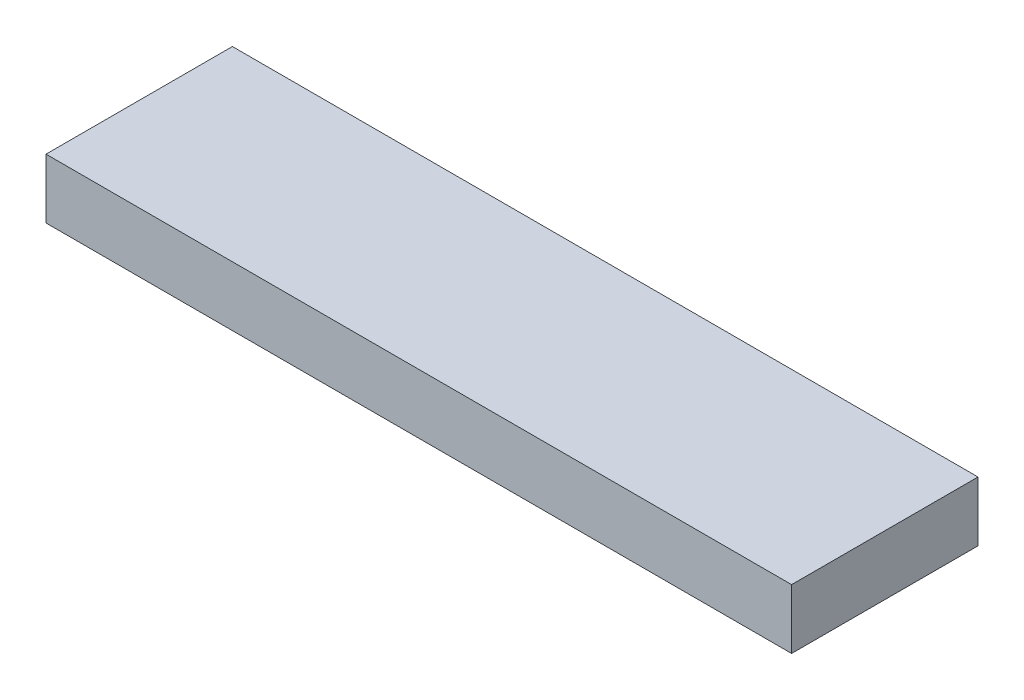
ISO-10303-21;
HEADER;
FILE_DESCRIPTION(('STEP AP214'),'2;1');
FILE_NAME('part.step','',(''),(''),'','','');
FILE_SCHEMA(('AUTOMOTIVE_DESIGN { 1 0 10303 214 1 1 1 1 }'));
ENDSEC;
DATA;
#1=APPLICATION_CONTEXT('core data for automotive mechanical design processes');
#2=APPLICATION_PROTOCOL_DEFINITION('international standard','automotive_design',2000,#1);
#3=PRODUCT_CONTEXT('',#1,'mechanical');
#4=PRODUCT('Part','Part','',(#3));
#5=PRODUCT_RELATED_PRODUCT_CATEGORY('part','',(#4));
#6=PRODUCT_DEFINITION_FORMATION('','',#4);
#7=PRODUCT_DEFINITION_CONTEXT('part definition',#1,'design');
#8=PRODUCT_DEFINITION('design','',#6,#7);
#9=PRODUCT_DEFINITION_SHAPE('','',#8);
#10=(LENGTH_UNIT() NAMED_UNIT(*) SI_UNIT(.MILLI.,.METRE.));
#11=(NAMED_UNIT(*) PLANE_ANGLE_UNIT() SI_UNIT($,.RADIAN.));
#12=(NAMED_UNIT(*) SI_UNIT($,.STERADIAN.) SOLID_ANGLE_UNIT());
#13=UNCERTAINTY_MEASURE_WITH_UNIT(LENGTH_MEASURE(1.E-05),#10,'distance_accuracy_value','');
#14=(GEOMETRIC_REPRESENTATION_CONTEXT(3) GLOBAL_UNCERTAINTY_ASSIGNED_CONTEXT((#13)) GLOBAL_UNIT_ASSIGNED_CONTEXT((#10,
#11,#12)) REPRESENTATION_CONTEXT('',''));
#15=CARTESIAN_POINT('',(0.,0.,0.));
#16=DIRECTION('',(0.,0.,1.));
#17=DIRECTION('',(1.,0.,0.));
#18=AXIS2_PLACEMENT_3D('',#15,#16,#17);
#19=CARTESIAN_POINT('',(0.,32.,0.));
#20=DIRECTION('',(1.,0.,0.));
#21=DIRECTION('',(0.,0.,-1.));
#22=AXIS2_PLACEMENT_3D('',#19,#20,#21);
#23=PLANE('',#22);
#24=DIRECTION('',(0.,0.,1.));
#25=VECTOR('',#24,1.);
#26=CARTESIAN_POINT('',(0.,0.,0.));
#27=LINE('',#26,#25);
#28=CARTESIAN_POINT('',(0.,0.,-100.));
#29=VERTEX_POINT('',#28);
#30=CARTESIAN_POINT('',(0.,0.,0.));
#31=VERTEX_POINT('',#30);
#32=EDGE_CURVE('E93',#29,#31,#27,.T.);
#33=ORIENTED_EDGE('',*,*,#32,.T.);
#34=DIRECTION('',(0.,-1.,0.));
#35=VECTOR('',#34,1.);
#36=CARTESIAN_POINT('',(0.,32.,0.));
#37=LINE('',#36,#35);
#38=CARTESIAN_POINT('',(0.,32.,0.));
#39=VERTEX_POINT('',#38);
#40=EDGE_CURVE('E11',#39,#31,#37,.T.);
#41=ORIENTED_EDGE('',*,*,#40,.F.);
#42=DIRECTION('',(0.,0.,1.));
#43=VECTOR('',#42,1.);
#44=CARTESIAN_POINT('',(0.,32.,0.));
#45=LINE('',#44,#43);
#46=CARTESIAN_POINT('',(0.,32.,-100.));
#47=VERTEX_POINT('',#46);
#48=EDGE_CURVE('E81',#47,#39,#45,.T.);
#49=ORIENTED_EDGE('',*,*,#48,.F.);
#50=DIRECTION('',(0.,-1.,0.));
#51=VECTOR('',#50,1.);
#52=CARTESIAN_POINT('',(0.,32.,-100.));
#53=LINE('',#52,#51);
#54=EDGE_CURVE('E89',#47,#29,#53,.T.);
#55=ORIENTED_EDGE('',*,*,#54,.T.);
#56=EDGE_LOOP('',(#33,#41,#49,#55));
#57=FACE_BOUND('',#56,.T.);
#58=ADVANCED_FACE('F30',(#57),#23,.F.);
#59=CARTESIAN_POINT('',(0.,32.,0.));
#60=DIRECTION('',(0.,0.,-1.));
#61=DIRECTION('',(-1.,0.,0.));
#62=AXIS2_PLACEMENT_3D('',#59,#60,#61);
#63=PLANE('',#62);
#64=DIRECTION('',(1.,0.,0.));
#65=VECTOR('',#64,1.);
#66=CARTESIAN_POINT('',(0.,0.,0.));
#67=LINE('',#66,#65);
#68=CARTESIAN_POINT('',(400.,0.,0.));
#69=VERTEX_POINT('',#68);
#70=EDGE_CURVE('E85',#31,#69,#67,.T.);
#71=ORIENTED_EDGE('',*,*,#70,.T.);
#72=DIRECTION('',(0.,-1.,0.));
#73=VECTOR('',#72,1.);
#74=CARTESIAN_POINT('',(400.,32.,0.));
#75=LINE('',#74,#73);
#76=CARTESIAN_POINT('',(400.,32.,0.));
#77=VERTEX_POINT('',#76);
#78=EDGE_CURVE('E38',#77,#69,#75,.T.);
#79=ORIENTED_EDGE('',*,*,#78,.F.);
#80=DIRECTION('',(1.,0.,0.));
#81=VECTOR('',#80,1.);
#82=CARTESIAN_POINT('',(0.,32.,0.));
#83=LINE('',#82,#81);
#84=EDGE_CURVE('E76',#39,#77,#83,.T.);
#85=ORIENTED_EDGE('',*,*,#84,.F.);
#86=ORIENTED_EDGE('',*,*,#40,.T.);
#87=EDGE_LOOP('',(#71,#79,#85,#86));
#88=FACE_BOUND('',#87,.T.);
#89=ADVANCED_FACE('F84',(#88),#63,.F.);
#90=CARTESIAN_POINT('',(400.,32.,0.));
#91=DIRECTION('',(-1.,0.,0.));
#92=DIRECTION('',(0.,0.,1.));
#93=AXIS2_PLACEMENT_3D('',#90,#91,#92);
#94=PLANE('',#93);
#95=DIRECTION('',(0.,0.,-1.));
#96=VECTOR('',#95,1.);
#97=CARTESIAN_POINT('',(400.,0.,0.));
#98=LINE('',#97,#96);
#99=CARTESIAN_POINT('',(400.,0.,-100.));
#100=VERTEX_POINT('',#99);
#101=EDGE_CURVE('E63',#69,#100,#98,.T.);
#102=ORIENTED_EDGE('',*,*,#101,.T.);
#103=DIRECTION('',(0.,-1.,0.));
#104=VECTOR('',#103,1.);
#105=CARTESIAN_POINT('',(400.,32.,-100.));
#106=LINE('',#105,#104);
#107=CARTESIAN_POINT('',(400.,32.,-100.));
#108=VERTEX_POINT('',#107);
#109=EDGE_CURVE('E86',#108,#100,#106,.T.);
#110=ORIENTED_EDGE('',*,*,#109,.F.);
#111=DIRECTION('',(0.,0.,-1.));
#112=VECTOR('',#111,1.);
#113=CARTESIAN_POINT('',(400.,32.,0.));
#114=LINE('',#113,#112);
#115=EDGE_CURVE('E79',#77,#108,#114,.T.);
#116=ORIENTED_EDGE('',*,*,#115,.F.);
#117=ORIENTED_EDGE('',*,*,#78,.T.);
#118=EDGE_LOOP('',(#102,#110,#116,#117));
#119=FACE_BOUND('',#118,.T.);
#120=ADVANCED_FACE('F87',(#119),#94,.F.);
#121=CARTESIAN_POINT('',(0.,32.,-100.));
#122=DIRECTION('',(0.,0.,1.));
#123=DIRECTION('',(1.,0.,0.));
#124=AXIS2_PLACEMENT_3D('',#121,#122,#123);
#125=PLANE('',#124);
#126=DIRECTION('',(-1.,0.,0.));
#127=VECTOR('',#126,1.);
#128=CARTESIAN_POINT('',(0.,0.,-100.));
#129=LINE('',#128,#127);
#130=EDGE_CURVE('E69',#100,#29,#129,.T.);
#131=ORIENTED_EDGE('',*,*,#130,.T.);
#132=ORIENTED_EDGE('',*,*,#54,.F.);
#133=DIRECTION('',(-1.,0.,0.));
#134=VECTOR('',#133,1.);
#135=CARTESIAN_POINT('',(0.,32.,-100.));
#136=LINE('',#135,#134);
#137=EDGE_CURVE('E46',#108,#47,#136,.T.);
#138=ORIENTED_EDGE('',*,*,#137,.F.);
#139=ORIENTED_EDGE('',*,*,#109,.T.);
#140=EDGE_LOOP('',(#131,#132,#138,#139));
#141=FACE_BOUND('',#140,.T.);
#142=ADVANCED_FACE('F100',(#141),#125,.F.);
#143=CARTESIAN_POINT('',(0.,32.,-100.));
#144=DIRECTION('',(0.,-1.,0.));
#145=DIRECTION('',(0.,0.,-1.));
#146=AXIS2_PLACEMENT_3D('',#143,#144,#145);
#147=PLANE('',#146);
#148=ORIENTED_EDGE('',*,*,#48,.T.);
#149=ORIENTED_EDGE('',*,*,#84,.T.);
#150=ORIENTED_EDGE('',*,*,#115,.T.);
#151=ORIENTED_EDGE('',*,*,#137,.T.);
#152=EDGE_LOOP('',(#148,#149,#150,#151));
#153=FACE_BOUND('',#152,.T.);
#154=ADVANCED_FACE('F77',(#153),#147,.F.);
#155=CARTESIAN_POINT('',(0.,0.,-100.));
#156=DIRECTION('',(0.,-1.,0.));
#157=DIRECTION('',(0.,0.,-1.));
#158=AXIS2_PLACEMENT_3D('',#155,#156,#157);
#159=PLANE('',#158);
#160=ORIENTED_EDGE('',*,*,#32,.F.);
#161=ORIENTED_EDGE('',*,*,#130,.F.);
#162=ORIENTED_EDGE('',*,*,#101,.F.);
#163=ORIENTED_EDGE('',*,*,#70,.F.);
#164=EDGE_LOOP('',(#160,#161,#162,#163));
#165=FACE_BOUND('',#164,.T.);
#166=ADVANCED_FACE('F103',(#165),#159,.T.);
#167=CLOSED_SHELL('',(#58,#89,#120,#142,#154,#166));
#168=MANIFOLD_SOLID_BREP('B2',#167);
#169=ADVANCED_BREP_SHAPE_REPRESENTATION('',(#18,#168),#14);
#170=SHAPE_DEFINITION_REPRESENTATION(#9,#169);
ENDSEC;
END-ISO-10303-21;
